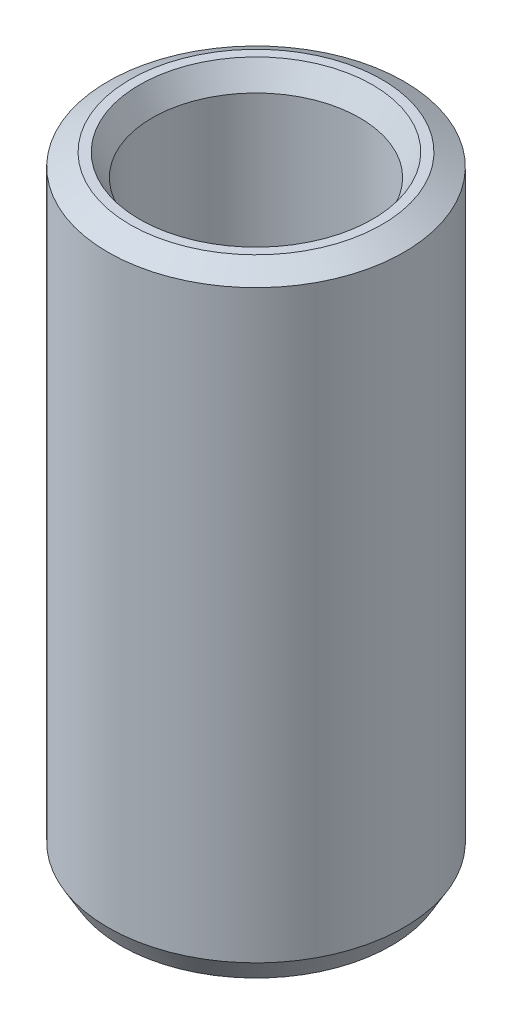
ISO-10303-21;
HEADER;
FILE_DESCRIPTION(('STEP AP214'),'2;1');
FILE_NAME('part.step','',(''),(''),'','','');
FILE_SCHEMA(('AUTOMOTIVE_DESIGN { 1 0 10303 214 1 1 1 1 }'));
ENDSEC;
DATA;
#1=APPLICATION_CONTEXT('core data for automotive mechanical design processes');
#2=APPLICATION_PROTOCOL_DEFINITION('international standard','automotive_design',2000,#1);
#3=PRODUCT_CONTEXT('',#1,'mechanical');
#4=PRODUCT('Part','Part','',(#3));
#5=PRODUCT_RELATED_PRODUCT_CATEGORY('part','',(#4));
#6=PRODUCT_DEFINITION_FORMATION('','',#4);
#7=PRODUCT_DEFINITION_CONTEXT('part definition',#1,'design');
#8=PRODUCT_DEFINITION('design','',#6,#7);
#9=PRODUCT_DEFINITION_SHAPE('','',#8);
#10=(LENGTH_UNIT() NAMED_UNIT(*) SI_UNIT(.MILLI.,.METRE.));
#11=(NAMED_UNIT(*) PLANE_ANGLE_UNIT() SI_UNIT($,.RADIAN.));
#12=(NAMED_UNIT(*) SI_UNIT($,.STERADIAN.) SOLID_ANGLE_UNIT());
#13=UNCERTAINTY_MEASURE_WITH_UNIT(LENGTH_MEASURE(1.E-05),#10,'distance_accuracy_value','');
#14=(GEOMETRIC_REPRESENTATION_CONTEXT(3) GLOBAL_UNCERTAINTY_ASSIGNED_CONTEXT((#13)) GLOBAL_UNIT_ASSIGNED_CONTEXT((#10,
#11,#12)) REPRESENTATION_CONTEXT('',''));
#15=CARTESIAN_POINT('',(0.,0.,0.));
#16=DIRECTION('',(0.,0.,1.));
#17=DIRECTION('',(1.,0.,0.));
#18=AXIS2_PLACEMENT_3D('',#15,#16,#17);
#19=CARTESIAN_POINT('',(0.,136.073168395273,0.));
#20=DIRECTION('',(0.,-1.,0.));
#21=DIRECTION('',(0.,0.,-1.));
#22=AXIS2_PLACEMENT_3D('',#19,#20,#21);
#23=CYLINDRICAL_SURFACE('',#22,32.5);
#24=CARTESIAN_POINT('',(0.,4.86707444511594,0.));
#25=DIRECTION('',(0.,1.,0.));
#26=DIRECTION('',(0.,0.,1.));
#27=AXIS2_PLACEMENT_3D('',#24,#25,#26);
#28=CIRCLE('',#27,32.5);
#29=CARTESIAN_POINT('',(0.,4.86707444511594,32.5));
#30=VERTEX_POINT('',#29);
#31=EDGE_CURVE('E10',#30,#30,#28,.T.);
#32=ORIENTED_EDGE('',*,*,#31,.T.);
#33=EDGE_LOOP('',(#32));
#34=FACE_BOUND('',#33,.T.);
#35=CARTESIAN_POINT('',(0.,133.26316165422,0.));
#36=DIRECTION('',(0.,1.,0.));
#37=DIRECTION('',(0.,0.,1.));
#38=AXIS2_PLACEMENT_3D('',#35,#36,#37);
#39=CIRCLE('',#38,32.5);
#40=CARTESIAN_POINT('',(0.,133.26316165422,32.5));
#41=VERTEX_POINT('',#40);
#42=EDGE_CURVE('E50',#41,#41,#39,.F.);
#43=ORIENTED_EDGE('',*,*,#42,.T.);
#44=EDGE_LOOP('',(#43));
#45=FACE_BOUND('',#44,.T.);
#46=ADVANCED_FACE('F39',(#34,#45),#23,.T.);
#47=CARTESIAN_POINT('',(0.,136.073168395273,0.));
#48=DIRECTION('',(0.,1.,0.));
#49=DIRECTION('',(0.,0.,1.));
#50=AXIS2_PLACEMENT_3D('',#47,#48,#49);
#51=PLANE('',#50);
#52=CARTESIAN_POINT('',(0.,136.073168395273,0.));
#53=DIRECTION('',(0.,1.,0.));
#54=DIRECTION('',(0.,0.,1.));
#55=AXIS2_PLACEMENT_3D('',#52,#53,#54);
#56=CIRCLE('',#55,25.5828809383959);
#57=CARTESIAN_POINT('',(0.,136.073168395273,25.5828809383959));
#58=VERTEX_POINT('',#57);
#59=EDGE_CURVE('E58',#58,#58,#56,.F.);
#60=ORIENTED_EDGE('',*,*,#59,.T.);
#61=EDGE_LOOP('',(#60));
#62=FACE_BOUND('',#61,.T.);
#63=CARTESIAN_POINT('',(0.,136.073168395273,0.));
#64=DIRECTION('',(0.,1.,0.));
#65=DIRECTION('',(0.,0.,1.));
#66=AXIS2_PLACEMENT_3D('',#63,#64,#65);
#67=CIRCLE('',#66,27.632925554884);
#68=CARTESIAN_POINT('',(0.,136.073168395273,27.632925554884));
#69=VERTEX_POINT('',#68);
#70=EDGE_CURVE('E61',#69,#69,#67,.T.);
#71=ORIENTED_EDGE('',*,*,#70,.T.);
#72=EDGE_LOOP('',(#71));
#73=FACE_BOUND('',#72,.T.);
#74=ADVANCED_FACE('F88',(#62,#73),#51,.T.);
#75=CARTESIAN_POINT('',(0.,0.,0.));
#76=DIRECTION('',(0.,1.,0.));
#77=DIRECTION('',(0.,0.,1.));
#78=AXIS2_PLACEMENT_3D('',#75,#76,#77);
#79=PLANE('',#78);
#80=CARTESIAN_POINT('',(0.,0.,0.));
#81=DIRECTION('',(0.,1.,0.));
#82=DIRECTION('',(0.,0.,1.));
#83=AXIS2_PLACEMENT_3D('',#80,#81,#82);
#84=CIRCLE('',#83,27.6399486424582);
#85=CARTESIAN_POINT('',(0.,0.,27.6399486424582));
#86=VERTEX_POINT('',#85);
#87=EDGE_CURVE('E51',#86,#86,#84,.T.);
#88=ORIENTED_EDGE('',*,*,#87,.T.);
#89=EDGE_LOOP('',(#88));
#90=FACE_BOUND('',#89,.T.);
#91=CARTESIAN_POINT('',(0.,0.,0.));
#92=DIRECTION('',(0.,1.,0.));
#93=DIRECTION('',(0.,0.,1.));
#94=AXIS2_PLACEMENT_3D('',#91,#92,#93);
#95=CIRCLE('',#94,29.6899932589463);
#96=CARTESIAN_POINT('',(0.,0.,29.6899932589463));
#97=VERTEX_POINT('',#96);
#98=EDGE_CURVE('E54',#97,#97,#95,.F.);
#99=ORIENTED_EDGE('',*,*,#98,.T.);
#100=EDGE_LOOP('',(#99));
#101=FACE_BOUND('',#100,.T.);
#102=ADVANCED_FACE('F83',(#90,#101),#79,.F.);
#103=CARTESIAN_POINT('',(0.,136.073168395273,0.));
#104=DIRECTION('',(0.,-1.,0.));
#105=DIRECTION('',(0.,0.,-1.));
#106=AXIS2_PLACEMENT_3D('',#103,#104,#105);
#107=CYLINDRICAL_SURFACE('',#106,22.7728741973422);
#108=CARTESIAN_POINT('',(0.,131.206093950157,0.));
#109=DIRECTION('',(0.,1.,0.));
#110=DIRECTION('',(0.,0.,1.));
#111=AXIS2_PLACEMENT_3D('',#108,#109,#110);
#112=CIRCLE('',#111,22.7728741973422);
#113=CARTESIAN_POINT('',(0.,131.206093950157,22.7728741973422));
#114=VERTEX_POINT('',#113);
#115=EDGE_CURVE('E67',#114,#114,#112,.T.);
#116=ORIENTED_EDGE('',*,*,#115,.T.);
#117=EDGE_LOOP('',(#116));
#118=FACE_BOUND('',#117,.T.);
#119=CARTESIAN_POINT('',(0.,2.81000674105369,0.));
#120=DIRECTION('',(0.,1.,0.));
#121=DIRECTION('',(0.,0.,1.));
#122=AXIS2_PLACEMENT_3D('',#119,#120,#121);
#123=CIRCLE('',#122,22.7728741973422);
#124=CARTESIAN_POINT('',(0.,2.81000674105369,22.7728741973422));
#125=VERTEX_POINT('',#124);
#126=EDGE_CURVE('E69',#125,#125,#123,.F.);
#127=ORIENTED_EDGE('',*,*,#126,.T.);
#128=EDGE_LOOP('',(#127));
#129=FACE_BOUND('',#128,.T.);
#130=ADVANCED_FACE('F71',(#118,#129),#107,.F.);
#131=CARTESIAN_POINT('',(0.,131.206093950157,0.));
#132=DIRECTION('',(0.,1.,0.));
#133=DIRECTION('',(0.,0.,1.));
#134=AXIS2_PLACEMENT_3D('',#131,#132,#133);
#135=CONICAL_SURFACE('',#134,22.7728741973422,0.523598775598301);
#136=ORIENTED_EDGE('',*,*,#59,.F.);
#137=EDGE_LOOP('',(#136));
#138=FACE_BOUND('',#137,.T.);
#139=ORIENTED_EDGE('',*,*,#115,.F.);
#140=EDGE_LOOP('',(#139));
#141=FACE_BOUND('',#140,.T.);
#142=ADVANCED_FACE('F77',(#138,#141),#135,.F.);
#143=CARTESIAN_POINT('',(0.,0.,0.));
#144=DIRECTION('',(0.,-1.,0.));
#145=DIRECTION('',(0.,0.,-1.));
#146=AXIS2_PLACEMENT_3D('',#143,#144,#145);
#147=CONICAL_SURFACE('',#146,27.6399486424582,1.04719755119659);
#148=ORIENTED_EDGE('',*,*,#126,.F.);
#149=EDGE_LOOP('',(#148));
#150=FACE_BOUND('',#149,.T.);
#151=ORIENTED_EDGE('',*,*,#87,.F.);
#152=EDGE_LOOP('',(#151));
#153=FACE_BOUND('',#152,.T.);
#154=ADVANCED_FACE('F73',(#150,#153),#147,.F.);
#155=CARTESIAN_POINT('',(0.,4.86707444511594,0.));
#156=DIRECTION('',(0.,1.,0.));
#157=DIRECTION('',(0.,0.,1.));
#158=AXIS2_PLACEMENT_3D('',#155,#156,#157);
#159=CONICAL_SURFACE('',#158,32.5,0.523598775598302);
#160=ORIENTED_EDGE('',*,*,#98,.F.);
#161=EDGE_LOOP('',(#160));
#162=FACE_BOUND('',#161,.T.);
#163=ORIENTED_EDGE('',*,*,#31,.F.);
#164=EDGE_LOOP('',(#163));
#165=FACE_BOUND('',#164,.T.);
#166=ADVANCED_FACE('F76',(#162,#165),#159,.T.);
#167=CARTESIAN_POINT('',(0.,136.073168395273,0.));
#168=DIRECTION('',(0.,-1.,0.));
#169=DIRECTION('',(0.,0.,-1.));
#170=AXIS2_PLACEMENT_3D('',#167,#168,#169);
#171=CONICAL_SURFACE('',#170,27.632925554884,1.0471975511966);
#172=ORIENTED_EDGE('',*,*,#42,.F.);
#173=EDGE_LOOP('',(#172));
#174=FACE_BOUND('',#173,.T.);
#175=ORIENTED_EDGE('',*,*,#70,.F.);
#176=EDGE_LOOP('',(#175));
#177=FACE_BOUND('',#176,.T.);
#178=ADVANCED_FACE('F45',(#174,#177),#171,.T.);
#179=CLOSED_SHELL('',(#46,#74,#102,#130,#142,#154,#166,#178));
#180=MANIFOLD_SOLID_BREP('B2',#179);
#181=ADVANCED_BREP_SHAPE_REPRESENTATION('',(#18,#180),#14);
#182=SHAPE_DEFINITION_REPRESENTATION(#9,#181);
ENDSEC;
END-ISO-10303-21;
